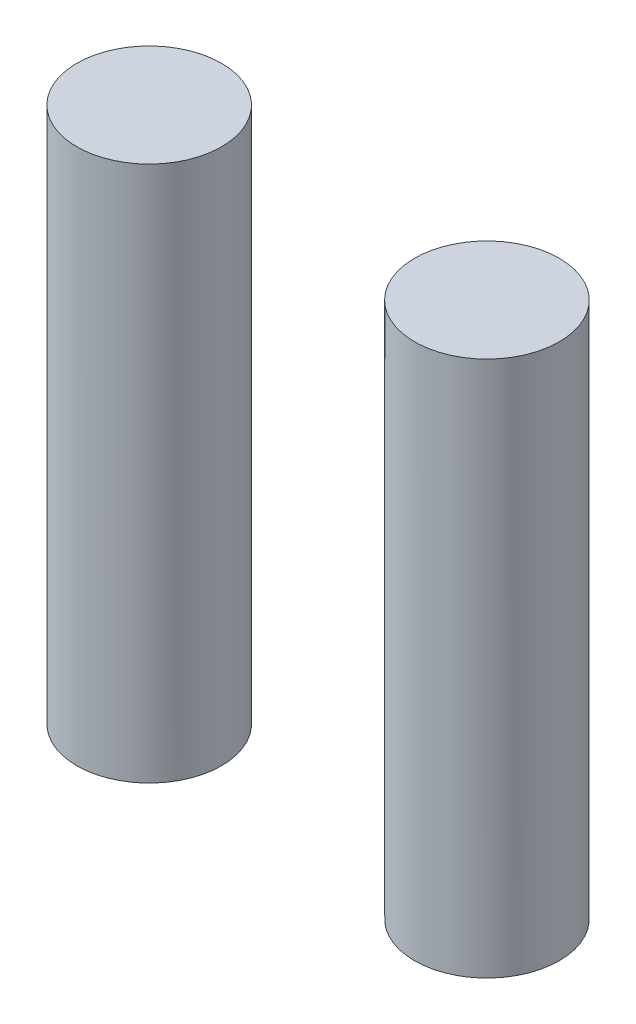
ISO-10303-21;
HEADER;
FILE_DESCRIPTION(('STEP AP214'),'2;1');
FILE_NAME('part.step','',(''),(''),'','','');
FILE_SCHEMA(('AUTOMOTIVE_DESIGN { 1 0 10303 214 1 1 1 1 }'));
ENDSEC;
DATA;
#1=APPLICATION_CONTEXT('core data for automotive mechanical design processes');
#2=APPLICATION_PROTOCOL_DEFINITION('international standard','automotive_design',2000,#1);
#3=PRODUCT_CONTEXT('',#1,'mechanical');
#4=PRODUCT('Part','Part','',(#3));
#5=PRODUCT_RELATED_PRODUCT_CATEGORY('part','',(#4));
#6=PRODUCT_DEFINITION_FORMATION('','',#4);
#7=PRODUCT_DEFINITION_CONTEXT('part definition',#1,'design');
#8=PRODUCT_DEFINITION('design','',#6,#7);
#9=PRODUCT_DEFINITION_SHAPE('','',#8);
#10=(LENGTH_UNIT() NAMED_UNIT(*) SI_UNIT(.MILLI.,.METRE.));
#11=(NAMED_UNIT(*) PLANE_ANGLE_UNIT() SI_UNIT($,.RADIAN.));
#12=(NAMED_UNIT(*) SI_UNIT($,.STERADIAN.) SOLID_ANGLE_UNIT());
#13=UNCERTAINTY_MEASURE_WITH_UNIT(LENGTH_MEASURE(1.E-05),#10,'distance_accuracy_value','');
#14=(GEOMETRIC_REPRESENTATION_CONTEXT(3) GLOBAL_UNCERTAINTY_ASSIGNED_CONTEXT((#13)) GLOBAL_UNIT_ASSIGNED_CONTEXT((#10,
#11,#12)) REPRESENTATION_CONTEXT('',''));
#15=CARTESIAN_POINT('',(0.,0.,0.));
#16=DIRECTION('',(0.,0.,1.));
#17=DIRECTION('',(1.,0.,0.));
#18=AXIS2_PLACEMENT_3D('',#15,#16,#17);
#19=CARTESIAN_POINT('',(47.,-144.6,78.5));
#20=DIRECTION('',(0.,-1.,0.));
#21=DIRECTION('',(1.,0.,0.));
#22=AXIS2_PLACEMENT_3D('',#19,#20,#21);
#23=CYLINDRICAL_SURFACE('',#22,13.5);
#24=CARTESIAN_POINT('',(47.,-144.6,78.5));
#25=DIRECTION('',(0.,-1.,0.));
#26=DIRECTION('',(0.,0.,-1.));
#27=AXIS2_PLACEMENT_3D('',#24,#25,#26);
#28=CIRCLE('',#27,13.5);
#29=CARTESIAN_POINT('',(47.,-144.6,65.));
#30=VERTEX_POINT('',#29);
#31=EDGE_CURVE('E27',#30,#30,#28,.F.);
#32=ORIENTED_EDGE('',*,*,#31,.F.);
#33=EDGE_LOOP('',(#32));
#34=FACE_BOUND('',#33,.T.);
#35=CARTESIAN_POINT('',(47.,-244.6,78.5));
#36=DIRECTION('',(0.,-1.,0.));
#37=DIRECTION('',(0.,0.,1.));
#38=AXIS2_PLACEMENT_3D('',#35,#36,#37);
#39=CIRCLE('',#38,13.5);
#40=CARTESIAN_POINT('',(47.,-244.6,92.));
#41=VERTEX_POINT('',#40);
#42=EDGE_CURVE('E10',#41,#41,#39,.T.);
#43=ORIENTED_EDGE('',*,*,#42,.F.);
#44=EDGE_LOOP('',(#43));
#45=FACE_BOUND('',#44,.T.);
#46=ADVANCED_FACE('F48',(#34,#45),#23,.T.);
#47=CARTESIAN_POINT('',(47.,-244.6,78.5));
#48=DIRECTION('',(0.,-1.,0.));
#49=DIRECTION('',(0.,0.,-1.));
#50=AXIS2_PLACEMENT_3D('',#47,#48,#49);
#51=PLANE('',#50);
#52=ORIENTED_EDGE('',*,*,#42,.T.);
#53=EDGE_LOOP('',(#52));
#54=FACE_BOUND('',#53,.T.);
#55=ADVANCED_FACE('F50',(#54),#51,.T.);
#56=CARTESIAN_POINT('',(0.,-144.6,0.));
#57=DIRECTION('',(0.,-1.,0.));
#58=DIRECTION('',(0.,0.,-1.));
#59=AXIS2_PLACEMENT_3D('',#56,#57,#58);
#60=PLANE('',#59);
#61=ORIENTED_EDGE('',*,*,#31,.T.);
#62=EDGE_LOOP('',(#61));
#63=FACE_BOUND('',#62,.T.);
#64=ADVANCED_FACE('F56',(#63),#60,.F.);
#65=CLOSED_SHELL('',(#46,#55,#64));
#66=MANIFOLD_SOLID_BREP('B1',#65);
#67=CARTESIAN_POINT('',(110.,-244.6,78.5));
#68=DIRECTION('',(0.,-1.,0.));
#69=DIRECTION('',(0.,0.,-1.));
#70=AXIS2_PLACEMENT_3D('',#67,#68,#69);
#71=PLANE('',#70);
#72=CARTESIAN_POINT('',(110.,-244.6,78.5));
#73=DIRECTION('',(0.,-1.,0.));
#74=DIRECTION('',(0.,0.,1.));
#75=AXIS2_PLACEMENT_3D('',#72,#73,#74);
#76=CIRCLE('',#75,13.5);
#77=CARTESIAN_POINT('',(110.,-244.6,92.));
#78=VERTEX_POINT('',#77);
#79=EDGE_CURVE('E19',#78,#78,#76,.T.);
#80=ORIENTED_EDGE('',*,*,#79,.T.);
#81=EDGE_LOOP('',(#80));
#82=FACE_BOUND('',#81,.T.);
#83=ADVANCED_FACE('F15',(#82),#71,.T.);
#84=CARTESIAN_POINT('',(110.,-144.6,78.5));
#85=DIRECTION('',(0.,-1.,0.));
#86=DIRECTION('',(1.,0.,0.));
#87=AXIS2_PLACEMENT_3D('',#84,#85,#86);
#88=CYLINDRICAL_SURFACE('',#87,13.5);
#89=CARTESIAN_POINT('',(110.,-144.6,78.5));
#90=DIRECTION('',(0.,-1.,0.));
#91=DIRECTION('',(0.,0.,-1.));
#92=AXIS2_PLACEMENT_3D('',#89,#90,#91);
#93=CIRCLE('',#92,13.5);
#94=CARTESIAN_POINT('',(110.,-144.6,65.));
#95=VERTEX_POINT('',#94);
#96=EDGE_CURVE('E31',#95,#95,#93,.F.);
#97=ORIENTED_EDGE('',*,*,#96,.F.);
#98=EDGE_LOOP('',(#97));
#99=FACE_BOUND('',#98,.T.);
#100=ORIENTED_EDGE('',*,*,#79,.F.);
#101=EDGE_LOOP('',(#100));
#102=FACE_BOUND('',#101,.T.);
#103=ADVANCED_FACE('F17',(#99,#102),#88,.T.);
#104=ORIENTED_EDGE('',*,*,#96,.T.);
#105=EDGE_LOOP('',(#104));
#106=FACE_BOUND('',#105,.T.);
#107=ADVANCED_FACE('F35',(#106),#60,.F.);
#108=CLOSED_SHELL('',(#83,#103,#107));
#109=MANIFOLD_SOLID_BREP('B1',#108);
#110=ADVANCED_BREP_SHAPE_REPRESENTATION('',(#18,#66,#109),#14);
#111=SHAPE_DEFINITION_REPRESENTATION(#9,#110);
ENDSEC;
END-ISO-10303-21;
